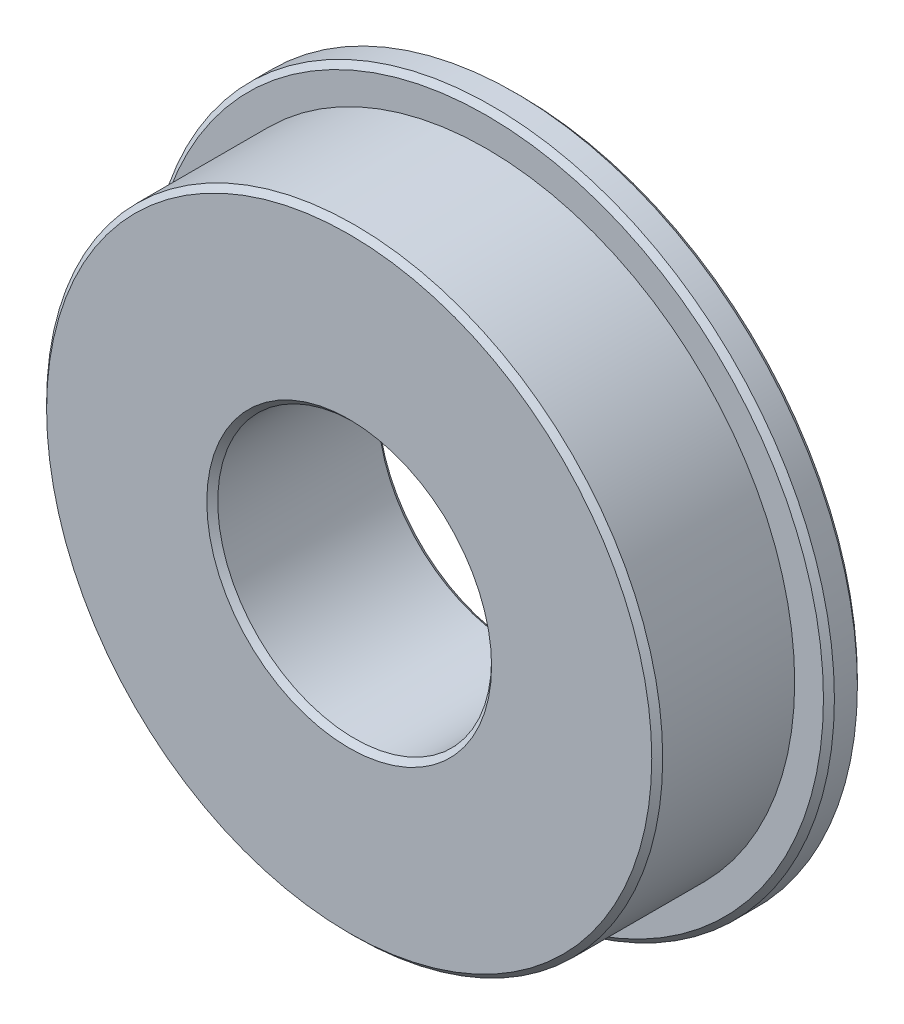
ISO-10303-21;
HEADER;
FILE_DESCRIPTION(('STEP AP214'),'2;1');
FILE_NAME('part.step','',(''),(''),'','','');
FILE_SCHEMA(('AUTOMOTIVE_DESIGN { 1 0 10303 214 1 1 1 1 }'));
ENDSEC;
DATA;
#1=APPLICATION_CONTEXT('core data for automotive mechanical design processes');
#2=APPLICATION_PROTOCOL_DEFINITION('international standard','automotive_design',2000,#1);
#3=PRODUCT_CONTEXT('',#1,'mechanical');
#4=PRODUCT('Part','Part','',(#3));
#5=PRODUCT_RELATED_PRODUCT_CATEGORY('part','',(#4));
#6=PRODUCT_DEFINITION_FORMATION('','',#4);
#7=PRODUCT_DEFINITION_CONTEXT('part definition',#1,'design');
#8=PRODUCT_DEFINITION('design','',#6,#7);
#9=PRODUCT_DEFINITION_SHAPE('','',#8);
#10=(LENGTH_UNIT() NAMED_UNIT(*) SI_UNIT(.MILLI.,.METRE.));
#11=(NAMED_UNIT(*) PLANE_ANGLE_UNIT() SI_UNIT($,.RADIAN.));
#12=(NAMED_UNIT(*) SI_UNIT($,.STERADIAN.) SOLID_ANGLE_UNIT());
#13=UNCERTAINTY_MEASURE_WITH_UNIT(LENGTH_MEASURE(1.E-05),#10,'distance_accuracy_value','');
#14=(GEOMETRIC_REPRESENTATION_CONTEXT(3) GLOBAL_UNCERTAINTY_ASSIGNED_CONTEXT((#13)) GLOBAL_UNIT_ASSIGNED_CONTEXT((#10,
#11,#12)) REPRESENTATION_CONTEXT('',''));
#15=CARTESIAN_POINT('',(0.,0.,0.));
#16=DIRECTION('',(0.,0.,1.));
#17=DIRECTION('',(1.,0.,0.));
#18=AXIS2_PLACEMENT_3D('',#15,#16,#17);
#19=CARTESIAN_POINT('',(-8.86153846153846,6.04195804195805,7.69619999999998));
#20=DIRECTION('',(0.,0.,-1.));
#21=DIRECTION('',(-1.,0.,0.));
#22=AXIS2_PLACEMENT_3D('',#19,#20,#21);
#23=CONICAL_SURFACE('',#22,14.2875,0.785398163397453);
#24=CARTESIAN_POINT('',(-8.86153846153846,6.04195804195805,7.95019999999999));
#25=DIRECTION('',(0.,0.,-1.));
#26=DIRECTION('',(-1.,0.,0.));
#27=AXIS2_PLACEMENT_3D('',#24,#25,#26);
#28=CIRCLE('',#27,14.0335);
#29=CARTESIAN_POINT('',(-22.8950384615385,6.04195804195805,7.95019999999999));
#30=VERTEX_POINT('',#29);
#31=EDGE_CURVE('E15',#30,#30,#28,.T.);
#32=ORIENTED_EDGE('',*,*,#31,.T.);
#33=EDGE_LOOP('',(#32));
#34=FACE_BOUND('',#33,.T.);
#35=CARTESIAN_POINT('',(-8.86153846153846,6.04195804195805,7.69619999999999));
#36=DIRECTION('',(0.,0.,1.));
#37=DIRECTION('',(1.,0.,0.));
#38=AXIS2_PLACEMENT_3D('',#35,#36,#37);
#39=CIRCLE('',#38,14.2875);
#40=CARTESIAN_POINT('',(5.42596153846154,6.04195804195805,7.69619999999999));
#41=VERTEX_POINT('',#40);
#42=EDGE_CURVE('E27',#41,#41,#39,.F.);
#43=ORIENTED_EDGE('',*,*,#42,.F.);
#44=EDGE_LOOP('',(#43));
#45=FACE_BOUND('',#44,.T.);
#46=ADVANCED_FACE('F12',(#34,#45),#23,.T.);
#47=CARTESIAN_POINT('',(-8.86153846153846,6.04195804195805,7.95019999999999));
#48=DIRECTION('',(0.,0.,1.));
#49=DIRECTION('',(1.,0.,0.));
#50=AXIS2_PLACEMENT_3D('',#47,#48,#49);
#51=CYLINDRICAL_SURFACE('',#50,14.2875);
#52=CARTESIAN_POINT('',(-8.86153846153846,6.04195804195805,1.57479999999999));
#53=DIRECTION('',(0.,0.,1.));
#54=DIRECTION('',(1.,0.,0.));
#55=AXIS2_PLACEMENT_3D('',#52,#53,#54);
#56=CIRCLE('',#55,14.2875);
#57=CARTESIAN_POINT('',(5.42596153846154,6.04195804195805,1.57479999999999));
#58=VERTEX_POINT('',#57);
#59=EDGE_CURVE('E36',#58,#58,#56,.T.);
#60=ORIENTED_EDGE('',*,*,#59,.T.);
#61=EDGE_LOOP('',(#60));
#62=FACE_BOUND('',#61,.T.);
#63=ORIENTED_EDGE('',*,*,#42,.T.);
#64=EDGE_LOOP('',(#63));
#65=FACE_BOUND('',#64,.T.);
#66=ADVANCED_FACE('F46',(#62,#65),#51,.T.);
#67=CARTESIAN_POINT('',(-8.86153846153846,6.04195804195805,7.95019999999999));
#68=DIRECTION('',(0.,0.,-1.));
#69=DIRECTION('',(-1.,0.,0.));
#70=AXIS2_PLACEMENT_3D('',#67,#68,#69);
#71=PLANE('',#70);
#72=ORIENTED_EDGE('',*,*,#31,.F.);
#73=EDGE_LOOP('',(#72));
#74=FACE_BOUND('',#73,.T.);
#75=CARTESIAN_POINT('',(-8.86153846153846,6.04195804195805,7.95019999998203));
#76=DIRECTION('',(0.,0.,1.));
#77=DIRECTION('',(1.,0.,0.));
#78=AXIS2_PLACEMENT_3D('',#75,#76,#77);
#79=CIRCLE('',#78,6.60399999993232);
#80=CARTESIAN_POINT('',(-2.25753846160615,6.04195804195805,7.95019999998203));
#81=VERTEX_POINT('',#80);
#82=EDGE_CURVE('E34',#81,#81,#79,.F.);
#83=ORIENTED_EDGE('',*,*,#82,.T.);
#84=EDGE_LOOP('',(#83));
#85=FACE_BOUND('',#84,.T.);
#86=ADVANCED_FACE('F53',(#74,#85),#71,.F.);
#87=CARTESIAN_POINT('',(-8.86153846153846,6.04195804195805,1.57479999999999));
#88=DIRECTION('',(0.,0.,-1.));
#89=DIRECTION('',(-1.,0.,0.));
#90=AXIS2_PLACEMENT_3D('',#87,#88,#89);
#91=PLANE('',#90);
#92=ORIENTED_EDGE('',*,*,#59,.F.);
#93=EDGE_LOOP('',(#92));
#94=FACE_BOUND('',#93,.T.);
#95=CARTESIAN_POINT('',(-8.86153846153846,6.04195804195805,1.5748));
#96=DIRECTION('',(0.,0.,-1.));
#97=DIRECTION('',(-1.,0.,0.));
#98=AXIS2_PLACEMENT_3D('',#95,#96,#97);
#99=CIRCLE('',#98,15.621);
#100=CARTESIAN_POINT('',(-24.4825384615385,6.04195804195805,1.5748));
#101=VERTEX_POINT('',#100);
#102=EDGE_CURVE('E30',#101,#101,#99,.T.);
#103=ORIENTED_EDGE('',*,*,#102,.F.);
#104=EDGE_LOOP('',(#103));
#105=FACE_BOUND('',#104,.T.);
#106=ADVANCED_FACE('F84',(#94,#105),#91,.F.);
#107=CARTESIAN_POINT('',(-8.86153846153846,6.04195804195805,7.95019999986835));
#108=DIRECTION('',(0.,0.,1.));
#109=DIRECTION('',(1.,0.,0.));
#110=AXIS2_PLACEMENT_3D('',#107,#108,#109);
#111=CONICAL_SURFACE('',#110,6.60399999981863,0.785398163285552);
#112=CARTESIAN_POINT('',(-8.86153846153846,6.04195804195805,7.69619999999999));
#113=DIRECTION('',(0.,0.,1.));
#114=DIRECTION('',(1.,0.,0.));
#115=AXIS2_PLACEMENT_3D('',#112,#113,#114);
#116=CIRCLE('',#115,6.35);
#117=CARTESIAN_POINT('',(-2.51153846153846,6.04195804195805,7.69619999999999));
#118=VERTEX_POINT('',#117);
#119=EDGE_CURVE('E33',#118,#118,#116,.F.);
#120=ORIENTED_EDGE('',*,*,#119,.T.);
#121=EDGE_LOOP('',(#120));
#122=FACE_BOUND('',#121,.T.);
#123=ORIENTED_EDGE('',*,*,#82,.F.);
#124=EDGE_LOOP('',(#123));
#125=FACE_BOUND('',#124,.T.);
#126=ADVANCED_FACE('F80',(#122,#125),#111,.F.);
#127=CARTESIAN_POINT('',(-8.86153846153846,6.04195804195805,1.32080000000001));
#128=DIRECTION('',(0.,0.,-1.));
#129=DIRECTION('',(-1.,0.,0.));
#130=AXIS2_PLACEMENT_3D('',#127,#128,#129);
#131=CONICAL_SURFACE('',#130,15.875,0.785398163397452);
#132=CARTESIAN_POINT('',(-8.86153846153846,6.04195804195805,1.32080000000001));
#133=DIRECTION('',(0.,0.,1.));
#134=DIRECTION('',(1.,0.,0.));
#135=AXIS2_PLACEMENT_3D('',#132,#133,#134);
#136=CIRCLE('',#135,15.875);
#137=CARTESIAN_POINT('',(7.01346153846154,6.04195804195805,1.32080000000001));
#138=VERTEX_POINT('',#137);
#139=EDGE_CURVE('E173',#138,#138,#136,.F.);
#140=ORIENTED_EDGE('',*,*,#139,.F.);
#141=EDGE_LOOP('',(#140));
#142=FACE_BOUND('',#141,.T.);
#143=ORIENTED_EDGE('',*,*,#102,.T.);
#144=EDGE_LOOP('',(#143));
#145=FACE_BOUND('',#144,.T.);
#146=ADVANCED_FACE('F76',(#142,#145),#131,.T.);
#147=CARTESIAN_POINT('',(-8.86153846153846,6.04195804195805,1.57479999999999));
#148=DIRECTION('',(0.,0.,1.));
#149=DIRECTION('',(1.,0.,0.));
#150=AXIS2_PLACEMENT_3D('',#147,#148,#149);
#151=CYLINDRICAL_SURFACE('',#150,6.35);
#152=ORIENTED_EDGE('',*,*,#119,.F.);
#153=EDGE_LOOP('',(#152));
#154=FACE_BOUND('',#153,.T.);
#155=CARTESIAN_POINT('',(-8.86153846153846,6.04195804195805,0.253999999927146));
#156=DIRECTION('',(0.,0.,-1.));
#157=DIRECTION('',(-1.,0.,0.));
#158=AXIS2_PLACEMENT_3D('',#155,#156,#157);
#159=CIRCLE('',#158,6.3499999999901);
#160=CARTESIAN_POINT('',(-15.2115384615286,6.04195804195805,0.253999999927146));
#161=VERTEX_POINT('',#160);
#162=EDGE_CURVE('E175',#161,#161,#159,.T.);
#163=ORIENTED_EDGE('',*,*,#162,.T.);
#164=EDGE_LOOP('',(#163));
#165=FACE_BOUND('',#164,.T.);
#166=ADVANCED_FACE('F72',(#154,#165),#151,.F.);
#167=CARTESIAN_POINT('',(-8.86153846153846,6.04195804195805,1.57479999999999));
#168=DIRECTION('',(0.,0.,1.));
#169=DIRECTION('',(1.,0.,0.));
#170=AXIS2_PLACEMENT_3D('',#167,#168,#169);
#171=CYLINDRICAL_SURFACE('',#170,15.875);
#172=CARTESIAN_POINT('',(-8.86153846153846,6.04195804195805,0.254000000000001));
#173=DIRECTION('',(0.,0.,1.));
#174=DIRECTION('',(1.,0.,0.));
#175=AXIS2_PLACEMENT_3D('',#172,#173,#174);
#176=CIRCLE('',#175,15.875);
#177=CARTESIAN_POINT('',(7.01346153846154,6.04195804195805,0.254000000000002));
#178=VERTEX_POINT('',#177);
#179=EDGE_CURVE('E24',#178,#178,#176,.F.);
#180=ORIENTED_EDGE('',*,*,#179,.F.);
#181=EDGE_LOOP('',(#180));
#182=FACE_BOUND('',#181,.T.);
#183=ORIENTED_EDGE('',*,*,#139,.T.);
#184=EDGE_LOOP('',(#183));
#185=FACE_BOUND('',#184,.T.);
#186=ADVANCED_FACE('F68',(#182,#185),#171,.T.);
#187=CARTESIAN_POINT('',(-8.86153846153846,6.04195804195805,-5.6843418860808E-11));
#188=DIRECTION('',(0.,0.,-1.));
#189=DIRECTION('',(-1.,0.,0.));
#190=AXIS2_PLACEMENT_3D('',#187,#188,#189);
#191=CONICAL_SURFACE('',#190,6.60399999997409,0.785398163397448);
#192=ORIENTED_EDGE('',*,*,#162,.F.);
#193=EDGE_LOOP('',(#192));
#194=FACE_BOUND('',#193,.T.);
#195=CARTESIAN_POINT('',(-8.86153846153846,6.04195804195805,-5.6843418860808E-11));
#196=DIRECTION('',(0.,0.,-1.));
#197=DIRECTION('',(-1.,0.,0.));
#198=AXIS2_PLACEMENT_3D('',#195,#196,#197);
#199=CIRCLE('',#198,6.60399999997409);
#200=CARTESIAN_POINT('',(-15.4655384615126,6.04195804195805,-5.6843418860808E-11));
#201=VERTEX_POINT('',#200);
#202=EDGE_CURVE('E19',#201,#201,#199,.F.);
#203=ORIENTED_EDGE('',*,*,#202,.F.);
#204=EDGE_LOOP('',(#203));
#205=FACE_BOUND('',#204,.T.);
#206=ADVANCED_FACE('F61',(#194,#205),#191,.F.);
#207=CARTESIAN_POINT('',(-8.86153846153846,6.04195804195805,0.254000000000001));
#208=DIRECTION('',(0.,0.,1.));
#209=DIRECTION('',(1.,0.,0.));
#210=AXIS2_PLACEMENT_3D('',#207,#208,#209);
#211=CONICAL_SURFACE('',#210,15.875,0.785398163397447);
#212=ORIENTED_EDGE('',*,*,#179,.T.);
#213=EDGE_LOOP('',(#212));
#214=FACE_BOUND('',#213,.T.);
#215=CARTESIAN_POINT('',(-8.86153846153846,6.04195804195805,0.));
#216=DIRECTION('',(0.,0.,1.));
#217=DIRECTION('',(1.,0.,0.));
#218=AXIS2_PLACEMENT_3D('',#215,#216,#217);
#219=CIRCLE('',#218,15.621);
#220=CARTESIAN_POINT('',(6.75946153846154,6.04195804195805,0.));
#221=VERTEX_POINT('',#220);
#222=EDGE_CURVE('E8',#221,#221,#219,.F.);
#223=ORIENTED_EDGE('',*,*,#222,.F.);
#224=EDGE_LOOP('',(#223));
#225=FACE_BOUND('',#224,.T.);
#226=ADVANCED_FACE('F56',(#214,#225),#211,.T.);
#227=CARTESIAN_POINT('',(-8.86153846153846,6.04195804195805,0.));
#228=DIRECTION('',(0.,0.,-1.));
#229=DIRECTION('',(-1.,0.,0.));
#230=AXIS2_PLACEMENT_3D('',#227,#228,#229);
#231=PLANE('',#230);
#232=ORIENTED_EDGE('',*,*,#222,.T.);
#233=EDGE_LOOP('',(#232));
#234=FACE_BOUND('',#233,.T.);
#235=ORIENTED_EDGE('',*,*,#202,.T.);
#236=EDGE_LOOP('',(#235));
#237=FACE_BOUND('',#236,.T.);
#238=ADVANCED_FACE('F54',(#234,#237),#231,.T.);
#239=CLOSED_SHELL('',(#46,#66,#86,#106,#126,#146,#166,#186,#206,#226,#238));
#240=MANIFOLD_SOLID_BREP('B1',#239);
#241=ADVANCED_BREP_SHAPE_REPRESENTATION('',(#18,#240),#14);
#242=SHAPE_DEFINITION_REPRESENTATION(#9,#241);
ENDSEC;
END-ISO-10303-21;
